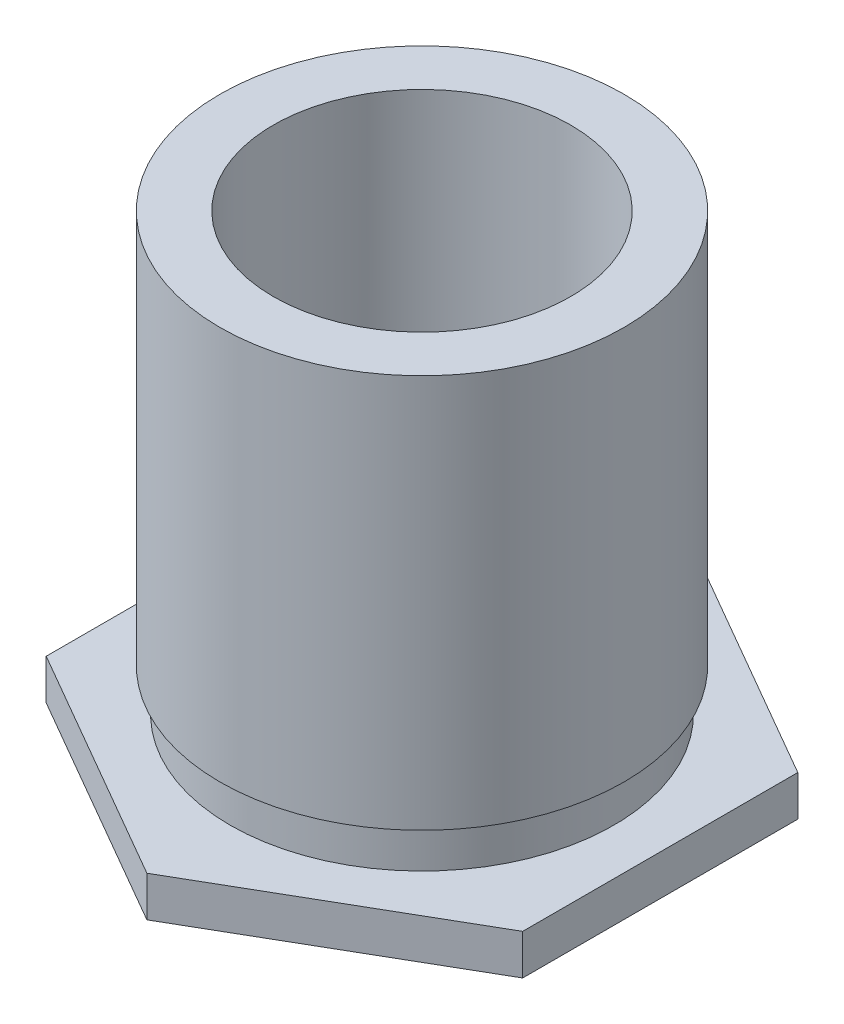
ISO-10303-21;
HEADER;
FILE_DESCRIPTION(('STEP AP214'),'2;1');
FILE_NAME('part.step','',(''),(''),'','','');
FILE_SCHEMA(('AUTOMOTIVE_DESIGN { 1 0 10303 214 1 1 1 1 }'));
ENDSEC;
DATA;
#1=APPLICATION_CONTEXT('core data for automotive mechanical design processes');
#2=APPLICATION_PROTOCOL_DEFINITION('international standard','automotive_design',2000,#1);
#3=PRODUCT_CONTEXT('',#1,'mechanical');
#4=PRODUCT('Part','Part','',(#3));
#5=PRODUCT_RELATED_PRODUCT_CATEGORY('part','',(#4));
#6=PRODUCT_DEFINITION_FORMATION('','',#4);
#7=PRODUCT_DEFINITION_CONTEXT('part definition',#1,'design');
#8=PRODUCT_DEFINITION('design','',#6,#7);
#9=PRODUCT_DEFINITION_SHAPE('','',#8);
#10=(LENGTH_UNIT() NAMED_UNIT(*) SI_UNIT(.MILLI.,.METRE.));
#11=(NAMED_UNIT(*) PLANE_ANGLE_UNIT() SI_UNIT($,.RADIAN.));
#12=(NAMED_UNIT(*) SI_UNIT($,.STERADIAN.) SOLID_ANGLE_UNIT());
#13=UNCERTAINTY_MEASURE_WITH_UNIT(LENGTH_MEASURE(1.E-05),#10,'distance_accuracy_value','');
#14=(GEOMETRIC_REPRESENTATION_CONTEXT(3) GLOBAL_UNCERTAINTY_ASSIGNED_CONTEXT((#13)) GLOBAL_UNIT_ASSIGNED_CONTEXT((#10,
#11,#12)) REPRESENTATION_CONTEXT('',''));
#15=CARTESIAN_POINT('',(0.,0.,0.));
#16=DIRECTION('',(0.,0.,1.));
#17=DIRECTION('',(1.,0.,0.));
#18=AXIS2_PLACEMENT_3D('',#15,#16,#17);
#19=CARTESIAN_POINT('',(3.683,0.53848,0.));
#20=DIRECTION('',(0.,1.,0.));
#21=DIRECTION('',(0.,0.,1.));
#22=AXIS2_PLACEMENT_3D('',#19,#20,#21);
#23=PLANE('',#22);
#24=CARTESIAN_POINT('',(0.,0.53848,0.));
#25=DIRECTION('',(0.,-1.,0.));
#26=DIRECTION('',(0.,0.,-1.));
#27=AXIS2_PLACEMENT_3D('',#24,#25,#26);
#28=CIRCLE('',#27,2.55778);
#29=CARTESIAN_POINT('',(0.,0.53848,-2.55778));
#30=VERTEX_POINT('',#29);
#31=EDGE_CURVE('E11',#30,#30,#28,.T.);
#32=ORIENTED_EDGE('',*,*,#31,.T.);
#33=EDGE_LOOP('',(#32));
#34=FACE_BOUND('',#33,.T.);
#35=DIRECTION('',(0.866025403784438,0.,0.5));
#36=VECTOR('',#35,1.);
#37=CARTESIAN_POINT('',(0.,0.53848,3.66617420935412));
#38=LINE('',#37,#36);
#39=CARTESIAN_POINT('',(-3.175,0.53848,1.83308710467706));
#40=VERTEX_POINT('',#39);
#41=CARTESIAN_POINT('',(0.,0.53848,3.66617420935412));
#42=VERTEX_POINT('',#41);
#43=EDGE_CURVE('E118',#40,#42,#38,.T.);
#44=ORIENTED_EDGE('',*,*,#43,.T.);
#45=DIRECTION('',(0.866025403784438,0.,-0.5));
#46=VECTOR('',#45,1.);
#47=CARTESIAN_POINT('',(3.175,0.53848,1.83308710467706));
#48=LINE('',#47,#46);
#49=CARTESIAN_POINT('',(3.175,0.53848,1.83308710467706));
#50=VERTEX_POINT('',#49);
#51=EDGE_CURVE('E113',#42,#50,#48,.T.);
#52=ORIENTED_EDGE('',*,*,#51,.T.);
#53=DIRECTION('',(0.,0.,-1.));
#54=VECTOR('',#53,1.);
#55=CARTESIAN_POINT('',(3.175,0.53848,-1.83308710467706));
#56=LINE('',#55,#54);
#57=CARTESIAN_POINT('',(3.175,0.53848,-1.83308710467706));
#58=VERTEX_POINT('',#57);
#59=EDGE_CURVE('E111',#50,#58,#56,.T.);
#60=ORIENTED_EDGE('',*,*,#59,.T.);
#61=DIRECTION('',(-0.866025403784438,0.,-0.5));
#62=VECTOR('',#61,1.);
#63=CARTESIAN_POINT('',(0.,0.53848,-3.66617420935412));
#64=LINE('',#63,#62);
#65=CARTESIAN_POINT('',(0.,0.53848,-3.66617420935412));
#66=VERTEX_POINT('',#65);
#67=EDGE_CURVE('E52',#58,#66,#64,.T.);
#68=ORIENTED_EDGE('',*,*,#67,.T.);
#69=DIRECTION('',(-0.866025403784438,0.,0.5));
#70=VECTOR('',#69,1.);
#71=CARTESIAN_POINT('',(-3.175,0.53848,-1.83308710467706));
#72=LINE('',#71,#70);
#73=CARTESIAN_POINT('',(-3.175,0.53848,-1.83308710467706));
#74=VERTEX_POINT('',#73);
#75=EDGE_CURVE('E100',#66,#74,#72,.T.);
#76=ORIENTED_EDGE('',*,*,#75,.T.);
#77=DIRECTION('',(0.,0.,1.));
#78=VECTOR('',#77,1.);
#79=CARTESIAN_POINT('',(-3.175,0.53848,1.83308710467706));
#80=LINE('',#79,#78);
#81=EDGE_CURVE('E105',#74,#40,#80,.T.);
#82=ORIENTED_EDGE('',*,*,#81,.T.);
#83=EDGE_LOOP('',(#44,#52,#60,#68,#76,#82));
#84=FACE_BOUND('',#83,.T.);
#85=ADVANCED_FACE('F36',(#34,#84),#23,.T.);
#86=CARTESIAN_POINT('',(2.6924,0.,0.));
#87=DIRECTION('',(0.,-1.,0.));
#88=DIRECTION('',(0.,0.,-1.));
#89=AXIS2_PLACEMENT_3D('',#86,#87,#88);
#90=PLANE('',#89);
#91=CARTESIAN_POINT('',(0.,0.,0.));
#92=DIRECTION('',(0.,-1.,0.));
#93=DIRECTION('',(0.,0.,-1.));
#94=AXIS2_PLACEMENT_3D('',#91,#92,#93);
#95=CIRCLE('',#94,2.6924);
#96=CARTESIAN_POINT('',(0.,0.,-2.6924));
#97=VERTEX_POINT('',#96);
#98=EDGE_CURVE('E150',#97,#97,#95,.T.);
#99=ORIENTED_EDGE('',*,*,#98,.F.);
#100=EDGE_LOOP('',(#99));
#101=FACE_BOUND('',#100,.T.);
#102=DIRECTION('',(0.,0.,-1.));
#103=VECTOR('',#102,1.);
#104=CARTESIAN_POINT('',(3.175,0.,-1.83308710467706));
#105=LINE('',#104,#103);
#106=CARTESIAN_POINT('',(3.175,0.,1.83308710467706));
#107=VERTEX_POINT('',#106);
#108=CARTESIAN_POINT('',(3.175,0.,-1.83308710467706));
#109=VERTEX_POINT('',#108);
#110=EDGE_CURVE('E121',#107,#109,#105,.T.);
#111=ORIENTED_EDGE('',*,*,#110,.F.);
#112=DIRECTION('',(0.866025403784438,0.,-0.5));
#113=VECTOR('',#112,1.);
#114=CARTESIAN_POINT('',(3.175,0.,1.83308710467706));
#115=LINE('',#114,#113);
#116=CARTESIAN_POINT('',(0.,0.,3.66617420935412));
#117=VERTEX_POINT('',#116);
#118=EDGE_CURVE('E60',#117,#107,#115,.T.);
#119=ORIENTED_EDGE('',*,*,#118,.F.);
#120=DIRECTION('',(0.866025403784438,0.,0.5));
#121=VECTOR('',#120,1.);
#122=CARTESIAN_POINT('',(0.,0.,3.66617420935412));
#123=LINE('',#122,#121);
#124=CARTESIAN_POINT('',(-3.175,0.,1.83308710467706));
#125=VERTEX_POINT('',#124);
#126=EDGE_CURVE('E130',#125,#117,#123,.T.);
#127=ORIENTED_EDGE('',*,*,#126,.F.);
#128=DIRECTION('',(0.,0.,1.));
#129=VECTOR('',#128,1.);
#130=CARTESIAN_POINT('',(-3.175,0.,1.83308710467706));
#131=LINE('',#130,#129);
#132=CARTESIAN_POINT('',(-3.175,0.,-1.83308710467706));
#133=VERTEX_POINT('',#132);
#134=EDGE_CURVE('E127',#133,#125,#131,.T.);
#135=ORIENTED_EDGE('',*,*,#134,.F.);
#136=DIRECTION('',(-0.866025403784438,0.,0.5));
#137=VECTOR('',#136,1.);
#138=CARTESIAN_POINT('',(-3.175,0.,-1.83308710467706));
#139=LINE('',#138,#137);
#140=CARTESIAN_POINT('',(0.,0.,-3.66617420935412));
#141=VERTEX_POINT('',#140);
#142=EDGE_CURVE('E125',#141,#133,#139,.T.);
#143=ORIENTED_EDGE('',*,*,#142,.F.);
#144=DIRECTION('',(-0.866025403784438,0.,-0.5));
#145=VECTOR('',#144,1.);
#146=CARTESIAN_POINT('',(0.,0.,-3.66617420935412));
#147=LINE('',#146,#145);
#148=EDGE_CURVE('E92',#109,#141,#147,.T.);
#149=ORIENTED_EDGE('',*,*,#148,.F.);
#150=EDGE_LOOP('',(#111,#119,#127,#135,#143,#149));
#151=FACE_BOUND('',#150,.T.);
#152=ADVANCED_FACE('F195',(#101,#151),#90,.T.);
#153=CARTESIAN_POINT('',(0.,0.,0.));
#154=DIRECTION('',(0.,-1.,0.));
#155=DIRECTION('',(0.,0.,-1.));
#156=AXIS2_PLACEMENT_3D('',#153,#154,#155);
#157=CYLINDRICAL_SURFACE('',#156,2.55778);
#158=CARTESIAN_POINT('',(0.,1.103884,0.));
#159=DIRECTION('',(0.,-1.,0.));
#160=DIRECTION('',(0.,0.,-1.));
#161=AXIS2_PLACEMENT_3D('',#158,#159,#160);
#162=CIRCLE('',#161,2.55778);
#163=CARTESIAN_POINT('',(0.,1.103884,-2.55778));
#164=VERTEX_POINT('',#163);
#165=EDGE_CURVE('E44',#164,#164,#162,.T.);
#166=ORIENTED_EDGE('',*,*,#165,.T.);
#167=EDGE_LOOP('',(#166));
#168=FACE_BOUND('',#167,.T.);
#169=ORIENTED_EDGE('',*,*,#31,.F.);
#170=EDGE_LOOP('',(#169));
#171=FACE_BOUND('',#170,.T.);
#172=ADVANCED_FACE('F189',(#168,#171),#157,.T.);
#173=CARTESIAN_POINT('',(2.6924,1.103884,0.));
#174=DIRECTION('',(0.,-1.,0.));
#175=DIRECTION('',(0.,0.,-1.));
#176=AXIS2_PLACEMENT_3D('',#173,#174,#175);
#177=PLANE('',#176);
#178=CARTESIAN_POINT('',(0.,1.103884,0.));
#179=DIRECTION('',(0.,-1.,0.));
#180=DIRECTION('',(0.,0.,-1.));
#181=AXIS2_PLACEMENT_3D('',#178,#179,#180);
#182=CIRCLE('',#181,2.6924);
#183=CARTESIAN_POINT('',(0.,1.103884,-2.6924));
#184=VERTEX_POINT('',#183);
#185=EDGE_CURVE('E160',#184,#184,#182,.T.);
#186=ORIENTED_EDGE('',*,*,#185,.T.);
#187=EDGE_LOOP('',(#186));
#188=FACE_BOUND('',#187,.T.);
#189=ORIENTED_EDGE('',*,*,#165,.F.);
#190=EDGE_LOOP('',(#189));
#191=FACE_BOUND('',#190,.T.);
#192=ADVANCED_FACE('F183',(#188,#191),#177,.T.);
#193=CARTESIAN_POINT('',(0.,0.,0.));
#194=DIRECTION('',(0.,-1.,0.));
#195=DIRECTION('',(0.,0.,-1.));
#196=AXIS2_PLACEMENT_3D('',#193,#194,#195);
#197=CYLINDRICAL_SURFACE('',#196,2.6924);
#198=CARTESIAN_POINT('',(0.,6.35,0.));
#199=DIRECTION('',(0.,-1.,0.));
#200=DIRECTION('',(0.,0.,-1.));
#201=AXIS2_PLACEMENT_3D('',#198,#199,#200);
#202=CIRCLE('',#201,2.6924);
#203=CARTESIAN_POINT('',(0.,6.35,-2.6924));
#204=VERTEX_POINT('',#203);
#205=EDGE_CURVE('E157',#204,#204,#202,.T.);
#206=ORIENTED_EDGE('',*,*,#205,.T.);
#207=EDGE_LOOP('',(#206));
#208=FACE_BOUND('',#207,.T.);
#209=ORIENTED_EDGE('',*,*,#185,.F.);
#210=EDGE_LOOP('',(#209));
#211=FACE_BOUND('',#210,.T.);
#212=ADVANCED_FACE('F177',(#208,#211),#197,.T.);
#213=CARTESIAN_POINT('',(2.6924,6.35,0.));
#214=DIRECTION('',(0.,1.,0.));
#215=DIRECTION('',(0.,0.,1.));
#216=AXIS2_PLACEMENT_3D('',#213,#214,#215);
#217=PLANE('',#216);
#218=CARTESIAN_POINT('',(0.,6.35,0.));
#219=DIRECTION('',(0.,1.,0.));
#220=DIRECTION('',(0.,0.,1.));
#221=AXIS2_PLACEMENT_3D('',#218,#219,#220);
#222=CIRCLE('',#221,1.9812);
#223=CARTESIAN_POINT('',(0.,6.35,1.9812));
#224=VERTEX_POINT('',#223);
#225=EDGE_CURVE('E39',#224,#224,#222,.T.);
#226=ORIENTED_EDGE('',*,*,#225,.F.);
#227=EDGE_LOOP('',(#226));
#228=FACE_BOUND('',#227,.T.);
#229=ORIENTED_EDGE('',*,*,#205,.F.);
#230=EDGE_LOOP('',(#229));
#231=FACE_BOUND('',#230,.T.);
#232=ADVANCED_FACE('F173',(#228,#231),#217,.T.);
#233=CARTESIAN_POINT('',(0.,0.,0.));
#234=DIRECTION('',(0.,-1.,0.));
#235=DIRECTION('',(0.,0.,-1.));
#236=AXIS2_PLACEMENT_3D('',#233,#234,#235);
#237=CYLINDRICAL_SURFACE('',#236,1.35255);
#238=CARTESIAN_POINT('',(0.,1.32018601654146,0.));
#239=DIRECTION('',(0.,-1.,0.));
#240=DIRECTION('',(0.,0.,-1.));
#241=AXIS2_PLACEMENT_3D('',#238,#239,#240);
#242=CIRCLE('',#241,1.35255);
#243=CARTESIAN_POINT('',(0.,1.32018601654146,-1.35255));
#244=VERTEX_POINT('',#243);
#245=EDGE_CURVE('E144',#244,#244,#242,.T.);
#246=ORIENTED_EDGE('',*,*,#245,.F.);
#247=EDGE_LOOP('',(#246));
#248=FACE_BOUND('',#247,.T.);
#249=CARTESIAN_POINT('',(0.,0.00253999999999981,0.));
#250=DIRECTION('',(0.,-1.,0.));
#251=DIRECTION('',(0.,0.,-1.));
#252=AXIS2_PLACEMENT_3D('',#249,#250,#251);
#253=CIRCLE('',#252,1.35255);
#254=CARTESIAN_POINT('',(0.,0.00253999999999981,-1.35255));
#255=VERTEX_POINT('',#254);
#256=EDGE_CURVE('E154',#255,#255,#253,.T.);
#257=ORIENTED_EDGE('',*,*,#256,.T.);
#258=EDGE_LOOP('',(#257));
#259=FACE_BOUND('',#258,.T.);
#260=ADVANCED_FACE('F176',(#248,#259),#237,.F.);
#261=CARTESIAN_POINT('',(2.6924,0.00253999999999981,0.));
#262=DIRECTION('',(0.,-1.,0.));
#263=DIRECTION('',(0.,0.,-1.));
#264=AXIS2_PLACEMENT_3D('',#261,#262,#263);
#265=PLANE('',#264);
#266=ORIENTED_EDGE('',*,*,#256,.F.);
#267=EDGE_LOOP('',(#266));
#268=FACE_BOUND('',#267,.T.);
#269=CARTESIAN_POINT('',(0.,0.00254000000000007,0.));
#270=DIRECTION('',(0.,-1.,0.));
#271=DIRECTION('',(0.,0.,-1.));
#272=AXIS2_PLACEMENT_3D('',#269,#270,#271);
#273=CIRCLE('',#272,2.6924);
#274=CARTESIAN_POINT('',(0.,0.00254000000000007,-2.6924));
#275=VERTEX_POINT('',#274);
#276=EDGE_CURVE('E153',#275,#275,#273,.T.);
#277=ORIENTED_EDGE('',*,*,#276,.T.);
#278=EDGE_LOOP('',(#277));
#279=FACE_BOUND('',#278,.T.);
#280=ADVANCED_FACE('F215',(#268,#279),#265,.T.);
#281=CARTESIAN_POINT('',(0.,0.,0.));
#282=DIRECTION('',(0.,-1.,0.));
#283=DIRECTION('',(0.,0.,-1.));
#284=AXIS2_PLACEMENT_3D('',#281,#282,#283);
#285=CYLINDRICAL_SURFACE('',#284,2.6924);
#286=ORIENTED_EDGE('',*,*,#98,.T.);
#287=EDGE_LOOP('',(#286));
#288=FACE_BOUND('',#287,.T.);
#289=ORIENTED_EDGE('',*,*,#276,.F.);
#290=EDGE_LOOP('',(#289));
#291=FACE_BOUND('',#290,.T.);
#292=ADVANCED_FACE('F212',(#288,#291),#285,.F.);
#293=CARTESIAN_POINT('',(1.9812,1.6002,0.));
#294=DIRECTION('',(0.,-1.,0.));
#295=DIRECTION('',(0.,0.,-1.));
#296=AXIS2_PLACEMENT_3D('',#293,#294,#295);
#297=PLANE('',#296);
#298=CARTESIAN_POINT('',(0.,1.6002,0.));
#299=DIRECTION('',(0.,-1.,0.));
#300=DIRECTION('',(0.,0.,-1.));
#301=AXIS2_PLACEMENT_3D('',#298,#299,#300);
#302=CIRCLE('',#301,1.9812);
#303=CARTESIAN_POINT('',(0.,1.6002,-1.9812));
#304=VERTEX_POINT('',#303);
#305=EDGE_CURVE('E136',#304,#304,#302,.T.);
#306=ORIENTED_EDGE('',*,*,#305,.F.);
#307=EDGE_LOOP('',(#306));
#308=FACE_BOUND('',#307,.T.);
#309=CARTESIAN_POINT('',(0.,1.6002,0.));
#310=DIRECTION('',(0.,-1.,0.));
#311=DIRECTION('',(0.,0.,-1.));
#312=AXIS2_PLACEMENT_3D('',#309,#310,#311);
#313=CIRCLE('',#312,1.7526);
#314=CARTESIAN_POINT('',(0.,1.6002,-1.7526));
#315=VERTEX_POINT('',#314);
#316=EDGE_CURVE('E147',#315,#315,#313,.T.);
#317=ORIENTED_EDGE('',*,*,#316,.T.);
#318=EDGE_LOOP('',(#317));
#319=FACE_BOUND('',#318,.T.);
#320=ADVANCED_FACE('F210',(#308,#319),#297,.F.);
#321=CARTESIAN_POINT('',(0.,1.32018601654146,0.));
#322=DIRECTION('',(0.,1.,0.));
#323=DIRECTION('',(0.,0.,1.));
#324=AXIS2_PLACEMENT_3D('',#321,#322,#323);
#325=CONICAL_SURFACE('',#324,1.35255,0.96010562152208);
#326=ORIENTED_EDGE('',*,*,#316,.F.);
#327=EDGE_LOOP('',(#326));
#328=FACE_BOUND('',#327,.T.);
#329=ORIENTED_EDGE('',*,*,#245,.T.);
#330=EDGE_LOOP('',(#329));
#331=FACE_BOUND('',#330,.T.);
#332=ADVANCED_FACE('F226',(#328,#331),#325,.F.);
#333=CARTESIAN_POINT('',(0.,-2.54,0.));
#334=DIRECTION('',(0.,-1.,0.));
#335=DIRECTION('',(0.,0.,-1.));
#336=AXIS2_PLACEMENT_3D('',#333,#334,#335);
#337=CYLINDRICAL_SURFACE('',#336,1.9812);
#338=ORIENTED_EDGE('',*,*,#225,.T.);
#339=EDGE_LOOP('',(#338));
#340=FACE_BOUND('',#339,.T.);
#341=ORIENTED_EDGE('',*,*,#305,.T.);
#342=EDGE_LOOP('',(#341));
#343=FACE_BOUND('',#342,.T.);
#344=ADVANCED_FACE('F170',(#340,#343),#337,.F.);
#345=CARTESIAN_POINT('',(3.175,0.,1.83308710467706));
#346=DIRECTION('',(0.5,0.,0.866025403784438));
#347=DIRECTION('',(0.866025403784439,0.,-0.5));
#348=AXIS2_PLACEMENT_3D('',#345,#346,#347);
#349=PLANE('',#348);
#350=ORIENTED_EDGE('',*,*,#51,.F.);
#351=DIRECTION('',(0.,1.,0.));
#352=VECTOR('',#351,1.);
#353=CARTESIAN_POINT('',(0.,0.,3.66617420935412));
#354=LINE('',#353,#352);
#355=EDGE_CURVE('E134',#117,#42,#354,.T.);
#356=ORIENTED_EDGE('',*,*,#355,.F.);
#357=ORIENTED_EDGE('',*,*,#118,.T.);
#358=DIRECTION('',(0.,1.,0.));
#359=VECTOR('',#358,1.);
#360=CARTESIAN_POINT('',(3.175,0.,1.83308710467706));
#361=LINE('',#360,#359);
#362=EDGE_CURVE('E133',#107,#50,#361,.T.);
#363=ORIENTED_EDGE('',*,*,#362,.T.);
#364=EDGE_LOOP('',(#350,#356,#357,#363));
#365=FACE_BOUND('',#364,.T.);
#366=ADVANCED_FACE('F233',(#365),#349,.T.);
#367=CARTESIAN_POINT('',(0.,0.,3.66617420935412));
#368=DIRECTION('',(-0.5,0.,0.866025403784438));
#369=DIRECTION('',(0.866025403784439,0.,0.5));
#370=AXIS2_PLACEMENT_3D('',#367,#368,#369);
#371=PLANE('',#370);
#372=ORIENTED_EDGE('',*,*,#43,.F.);
#373=DIRECTION('',(0.,1.,0.));
#374=VECTOR('',#373,1.);
#375=CARTESIAN_POINT('',(-3.175,0.,1.83308710467706));
#376=LINE('',#375,#374);
#377=EDGE_CURVE('E137',#125,#40,#376,.T.);
#378=ORIENTED_EDGE('',*,*,#377,.F.);
#379=ORIENTED_EDGE('',*,*,#126,.T.);
#380=ORIENTED_EDGE('',*,*,#355,.T.);
#381=EDGE_LOOP('',(#372,#378,#379,#380));
#382=FACE_BOUND('',#381,.T.);
#383=ADVANCED_FACE('F240',(#382),#371,.T.);
#384=CARTESIAN_POINT('',(-3.175,0.,1.83308710467706));
#385=DIRECTION('',(-1.,0.,0.));
#386=DIRECTION('',(0.,0.,1.));
#387=AXIS2_PLACEMENT_3D('',#384,#385,#386);
#388=PLANE('',#387);
#389=ORIENTED_EDGE('',*,*,#81,.F.);
#390=DIRECTION('',(0.,1.,0.));
#391=VECTOR('',#390,1.);
#392=CARTESIAN_POINT('',(-3.175,0.,-1.83308710467706));
#393=LINE('',#392,#391);
#394=EDGE_CURVE('E96',#133,#74,#393,.T.);
#395=ORIENTED_EDGE('',*,*,#394,.F.);
#396=ORIENTED_EDGE('',*,*,#134,.T.);
#397=ORIENTED_EDGE('',*,*,#377,.T.);
#398=EDGE_LOOP('',(#389,#395,#396,#397));
#399=FACE_BOUND('',#398,.T.);
#400=ADVANCED_FACE('F249',(#399),#388,.T.);
#401=CARTESIAN_POINT('',(-3.175,0.,-1.83308710467706));
#402=DIRECTION('',(-0.5,0.,-0.866025403784438));
#403=DIRECTION('',(-0.866025403784438,0.,0.5));
#404=AXIS2_PLACEMENT_3D('',#401,#402,#403);
#405=PLANE('',#404);
#406=ORIENTED_EDGE('',*,*,#75,.F.);
#407=DIRECTION('',(0.,1.,0.));
#408=VECTOR('',#407,1.);
#409=CARTESIAN_POINT('',(0.,0.,-3.66617420935412));
#410=LINE('',#409,#408);
#411=EDGE_CURVE('E88',#141,#66,#410,.T.);
#412=ORIENTED_EDGE('',*,*,#411,.F.);
#413=ORIENTED_EDGE('',*,*,#142,.T.);
#414=ORIENTED_EDGE('',*,*,#394,.T.);
#415=EDGE_LOOP('',(#406,#412,#413,#414));
#416=FACE_BOUND('',#415,.T.);
#417=ADVANCED_FACE('F101',(#416),#405,.T.);
#418=CARTESIAN_POINT('',(0.,0.,-3.66617420935412));
#419=DIRECTION('',(0.5,0.,-0.866025403784438));
#420=DIRECTION('',(-0.866025403784439,0.,-0.5));
#421=AXIS2_PLACEMENT_3D('',#418,#419,#420);
#422=PLANE('',#421);
#423=ORIENTED_EDGE('',*,*,#67,.F.);
#424=DIRECTION('',(0.,1.,0.));
#425=VECTOR('',#424,1.);
#426=CARTESIAN_POINT('',(3.175,0.,-1.83308710467706));
#427=LINE('',#426,#425);
#428=EDGE_CURVE('E97',#109,#58,#427,.T.);
#429=ORIENTED_EDGE('',*,*,#428,.F.);
#430=ORIENTED_EDGE('',*,*,#148,.T.);
#431=ORIENTED_EDGE('',*,*,#411,.T.);
#432=EDGE_LOOP('',(#423,#429,#430,#431));
#433=FACE_BOUND('',#432,.T.);
#434=ADVANCED_FACE('F90',(#433),#422,.T.);
#435=CARTESIAN_POINT('',(3.175,0.,-1.83308710467706));
#436=DIRECTION('',(1.,0.,0.));
#437=DIRECTION('',(0.,0.,-1.));
#438=AXIS2_PLACEMENT_3D('',#435,#436,#437);
#439=PLANE('',#438);
#440=ORIENTED_EDGE('',*,*,#59,.F.);
#441=ORIENTED_EDGE('',*,*,#362,.F.);
#442=ORIENTED_EDGE('',*,*,#110,.T.);
#443=ORIENTED_EDGE('',*,*,#428,.T.);
#444=EDGE_LOOP('',(#440,#441,#442,#443));
#445=FACE_BOUND('',#444,.T.);
#446=ADVANCED_FACE('F241',(#445),#439,.T.);
#447=CLOSED_SHELL('',(#85,#152,#172,#192,#212,#232,#260,#280,#292,#320,#332,#344,#366,#383,#400,
#417,#434,#446));
#448=MANIFOLD_SOLID_BREP('B2',#447);
#449=ADVANCED_BREP_SHAPE_REPRESENTATION('',(#18,#448),#14);
#450=SHAPE_DEFINITION_REPRESENTATION(#9,#449);
ENDSEC;
END-ISO-10303-21;
